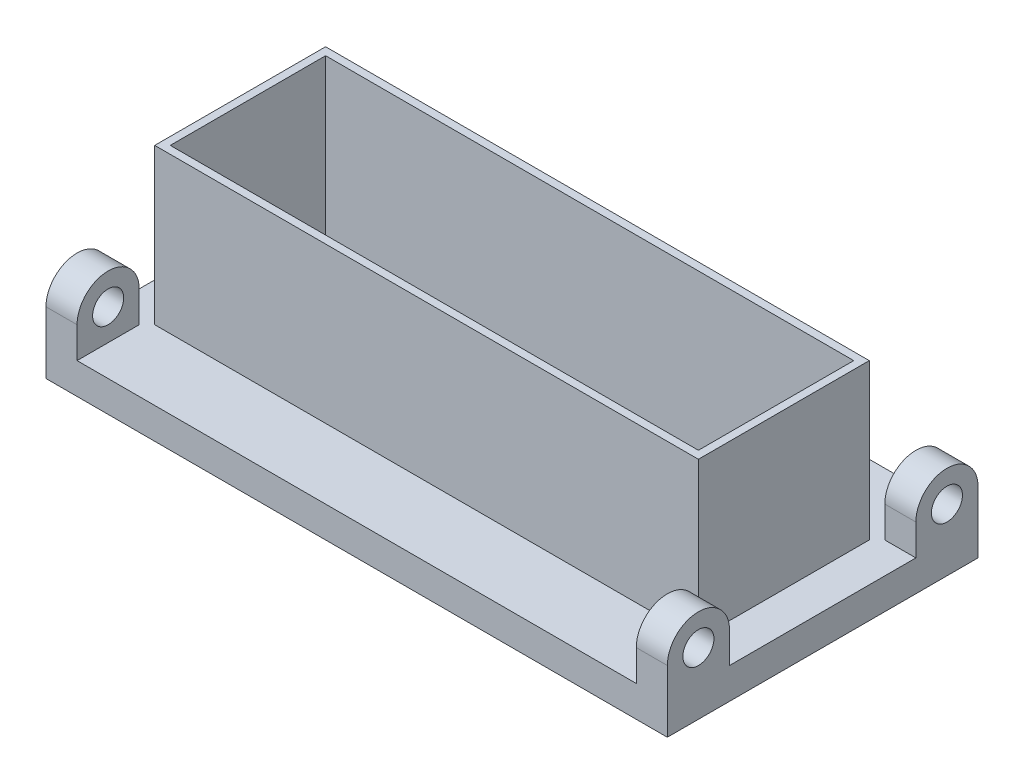
ISO-10303-21;
HEADER;
FILE_DESCRIPTION(('STEP AP214'),'2;1');
FILE_NAME('part.step','',(''),(''),'','','');
FILE_SCHEMA(('AUTOMOTIVE_DESIGN { 1 0 10303 214 1 1 1 1 }'));
ENDSEC;
DATA;
#1=APPLICATION_CONTEXT('core data for automotive mechanical design processes');
#2=APPLICATION_PROTOCOL_DEFINITION('international standard','automotive_design',2000,#1);
#3=PRODUCT_CONTEXT('',#1,'mechanical');
#4=PRODUCT('Part','Part','',(#3));
#5=PRODUCT_RELATED_PRODUCT_CATEGORY('part','',(#4));
#6=PRODUCT_DEFINITION_FORMATION('','',#4);
#7=PRODUCT_DEFINITION_CONTEXT('part definition',#1,'design');
#8=PRODUCT_DEFINITION('design','',#6,#7);
#9=PRODUCT_DEFINITION_SHAPE('','',#8);
#10=(LENGTH_UNIT() NAMED_UNIT(*) SI_UNIT(.MILLI.,.METRE.));
#11=(NAMED_UNIT(*) PLANE_ANGLE_UNIT() SI_UNIT($,.RADIAN.));
#12=(NAMED_UNIT(*) SI_UNIT($,.STERADIAN.) SOLID_ANGLE_UNIT());
#13=UNCERTAINTY_MEASURE_WITH_UNIT(LENGTH_MEASURE(1.E-05),#10,'distance_accuracy_value','');
#14=(GEOMETRIC_REPRESENTATION_CONTEXT(3) GLOBAL_UNCERTAINTY_ASSIGNED_CONTEXT((#13)) GLOBAL_UNIT_ASSIGNED_CONTEXT((#10,
#11,#12)) REPRESENTATION_CONTEXT('',''));
#15=CARTESIAN_POINT('',(0.,0.,0.));
#16=DIRECTION('',(0.,0.,1.));
#17=DIRECTION('',(1.,0.,0.));
#18=AXIS2_PLACEMENT_3D('',#15,#16,#17);
#19=CARTESIAN_POINT('',(100.,5.,50.));
#20=DIRECTION('',(0.,-1.,0.));
#21=DIRECTION('',(0.,0.,-1.));
#22=AXIS2_PLACEMENT_3D('',#19,#20,#21);
#23=PLANE('',#22);
#24=DIRECTION('',(1.,0.,0.));
#25=VECTOR('',#24,1.);
#26=CARTESIAN_POINT('',(0.,5.,-27.5));
#27=LINE('',#26,#25);
#28=CARTESIAN_POINT('',(-87.5,5.,-27.5));
#29=VERTEX_POINT('',#28);
#30=CARTESIAN_POINT('',(87.5,5.,-27.5));
#31=VERTEX_POINT('',#30);
#32=EDGE_CURVE('E61',#29,#31,#27,.T.);
#33=ORIENTED_EDGE('',*,*,#32,.T.);
#34=DIRECTION('',(0.,0.,1.));
#35=VECTOR('',#34,1.);
#36=CARTESIAN_POINT('',(87.5,5.,0.));
#37=LINE('',#36,#35);
#38=CARTESIAN_POINT('',(87.5,5.,27.5));
#39=VERTEX_POINT('',#38);
#40=EDGE_CURVE('E210',#31,#39,#37,.T.);
#41=ORIENTED_EDGE('',*,*,#40,.T.);
#42=DIRECTION('',(1.,0.,0.));
#43=VECTOR('',#42,1.);
#44=CARTESIAN_POINT('',(0.,5.,27.5));
#45=LINE('',#44,#43);
#46=CARTESIAN_POINT('',(-87.5,5.,27.5));
#47=VERTEX_POINT('',#46);
#48=EDGE_CURVE('E260',#47,#39,#45,.T.);
#49=ORIENTED_EDGE('',*,*,#48,.F.);
#50=DIRECTION('',(0.,0.,1.));
#51=VECTOR('',#50,1.);
#52=CARTESIAN_POINT('',(-87.5,5.,0.));
#53=LINE('',#52,#51);
#54=EDGE_CURVE('E66',#29,#47,#53,.T.);
#55=ORIENTED_EDGE('',*,*,#54,.F.);
#56=EDGE_LOOP('',(#33,#41,#49,#55));
#57=FACE_BOUND('',#56,.T.);
#58=DIRECTION('',(0.,0.,1.));
#59=VECTOR('',#58,1.);
#60=CARTESIAN_POINT('',(-100.,5.,50.));
#61=LINE('',#60,#59);
#62=CARTESIAN_POINT('',(-100.,5.,-30.));
#63=VERTEX_POINT('',#62);
#64=CARTESIAN_POINT('',(-100.,5.,30.));
#65=VERTEX_POINT('',#64);
#66=EDGE_CURVE('E483',#63,#65,#61,.T.);
#67=ORIENTED_EDGE('',*,*,#66,.T.);
#68=DIRECTION('',(-1.,0.,0.));
#69=VECTOR('',#68,1.);
#70=CARTESIAN_POINT('',(-90.,5.,30.));
#71=LINE('',#70,#69);
#72=CARTESIAN_POINT('',(-90.,5.,30.));
#73=VERTEX_POINT('',#72);
#74=EDGE_CURVE('E336',#73,#65,#71,.T.);
#75=ORIENTED_EDGE('',*,*,#74,.F.);
#76=DIRECTION('',(0.,0.,1.));
#77=VECTOR('',#76,1.);
#78=CARTESIAN_POINT('',(-90.,5.,0.));
#79=LINE('',#78,#77);
#80=CARTESIAN_POINT('',(-90.,5.,50.));
#81=VERTEX_POINT('',#80);
#82=EDGE_CURVE('E313',#73,#81,#79,.T.);
#83=ORIENTED_EDGE('',*,*,#82,.T.);
#84=DIRECTION('',(-1.,0.,0.));
#85=VECTOR('',#84,1.);
#86=CARTESIAN_POINT('',(100.,5.,50.));
#87=LINE('',#86,#85);
#88=CARTESIAN_POINT('',(90.,5.,50.));
#89=VERTEX_POINT('',#88);
#90=EDGE_CURVE('E54',#89,#81,#87,.T.);
#91=ORIENTED_EDGE('',*,*,#90,.F.);
#92=DIRECTION('',(0.,0.,1.));
#93=VECTOR('',#92,1.);
#94=CARTESIAN_POINT('',(90.,5.,0.));
#95=LINE('',#94,#93);
#96=CARTESIAN_POINT('',(90.,5.,30.));
#97=VERTEX_POINT('',#96);
#98=EDGE_CURVE('E439',#97,#89,#95,.T.);
#99=ORIENTED_EDGE('',*,*,#98,.F.);
#100=DIRECTION('',(1.,0.,0.));
#101=VECTOR('',#100,1.);
#102=CARTESIAN_POINT('',(90.,5.,30.));
#103=LINE('',#102,#101);
#104=CARTESIAN_POINT('',(100.,5.,30.));
#105=VERTEX_POINT('',#104);
#106=EDGE_CURVE('E460',#97,#105,#103,.T.);
#107=ORIENTED_EDGE('',*,*,#106,.T.);
#108=DIRECTION('',(0.,0.,1.));
#109=VECTOR('',#108,1.);
#110=CARTESIAN_POINT('',(100.,5.,50.));
#111=LINE('',#110,#109);
#112=CARTESIAN_POINT('',(100.,5.,-30.));
#113=VERTEX_POINT('',#112);
#114=EDGE_CURVE('E470',#113,#105,#111,.T.);
#115=ORIENTED_EDGE('',*,*,#114,.F.);
#116=DIRECTION('',(1.,0.,0.));
#117=VECTOR('',#116,1.);
#118=CARTESIAN_POINT('',(90.,5.,-30.));
#119=LINE('',#118,#117);
#120=CARTESIAN_POINT('',(90.,5.,-30.));
#121=VERTEX_POINT('',#120);
#122=EDGE_CURVE('E420',#121,#113,#119,.T.);
#123=ORIENTED_EDGE('',*,*,#122,.F.);
#124=DIRECTION('',(0.,0.,-1.));
#125=VECTOR('',#124,1.);
#126=CARTESIAN_POINT('',(90.,5.,0.));
#127=LINE('',#126,#125);
#128=CARTESIAN_POINT('',(90.,5.,-50.));
#129=VERTEX_POINT('',#128);
#130=EDGE_CURVE('E398',#121,#129,#127,.T.);
#131=ORIENTED_EDGE('',*,*,#130,.T.);
#132=DIRECTION('',(-1.,0.,0.));
#133=VECTOR('',#132,1.);
#134=CARTESIAN_POINT('',(100.,5.,-50.));
#135=LINE('',#134,#133);
#136=CARTESIAN_POINT('',(-90.,5.,-50.));
#137=VERTEX_POINT('',#136);
#138=EDGE_CURVE('E11',#129,#137,#135,.T.);
#139=ORIENTED_EDGE('',*,*,#138,.T.);
#140=DIRECTION('',(0.,0.,-1.));
#141=VECTOR('',#140,1.);
#142=CARTESIAN_POINT('',(-90.,5.,0.));
#143=LINE('',#142,#141);
#144=CARTESIAN_POINT('',(-90.,5.,-30.));
#145=VERTEX_POINT('',#144);
#146=EDGE_CURVE('E355',#145,#137,#143,.T.);
#147=ORIENTED_EDGE('',*,*,#146,.F.);
#148=DIRECTION('',(-1.,0.,0.));
#149=VECTOR('',#148,1.);
#150=CARTESIAN_POINT('',(-90.,5.,-30.));
#151=LINE('',#150,#149);
#152=EDGE_CURVE('E378',#145,#63,#151,.T.);
#153=ORIENTED_EDGE('',*,*,#152,.T.);
#154=EDGE_LOOP('',(#67,#75,#83,#91,#99,#107,#115,#123,#131,#139,#147,#153));
#155=FACE_BOUND('',#154,.T.);
#156=ADVANCED_FACE('F45',(#57,#155),#23,.F.);
#157=CARTESIAN_POINT('',(100.,5.,-50.));
#158=DIRECTION('',(0.,0.,1.));
#159=DIRECTION('',(1.,0.,0.));
#160=AXIS2_PLACEMENT_3D('',#157,#158,#159);
#161=PLANE('',#160);
#162=DIRECTION('',(0.,1.,0.));
#163=VECTOR('',#162,1.);
#164=CARTESIAN_POINT('',(-100.,5.,-50.));
#165=LINE('',#164,#163);
#166=CARTESIAN_POINT('',(-100.,-5.,-50.));
#167=VERTEX_POINT('',#166);
#168=CARTESIAN_POINT('',(-100.,15.,-50.));
#169=VERTEX_POINT('',#168);
#170=EDGE_CURVE('E459',#167,#169,#165,.T.);
#171=ORIENTED_EDGE('',*,*,#170,.T.);
#172=DIRECTION('',(-1.,0.,0.));
#173=VECTOR('',#172,1.);
#174=CARTESIAN_POINT('',(-90.,15.,-50.));
#175=LINE('',#174,#173);
#176=CARTESIAN_POINT('',(-90.,15.,-50.));
#177=VERTEX_POINT('',#176);
#178=EDGE_CURVE('E363',#177,#169,#175,.T.);
#179=ORIENTED_EDGE('',*,*,#178,.F.);
#180=DIRECTION('',(0.,-1.,0.));
#181=VECTOR('',#180,1.);
#182=CARTESIAN_POINT('',(-90.,0.,-50.));
#183=LINE('',#182,#181);
#184=EDGE_CURVE('E351',#177,#137,#183,.T.);
#185=ORIENTED_EDGE('',*,*,#184,.T.);
#186=ORIENTED_EDGE('',*,*,#138,.F.);
#187=DIRECTION('',(0.,-1.,0.));
#188=VECTOR('',#187,1.);
#189=CARTESIAN_POINT('',(90.,0.,-50.));
#190=LINE('',#189,#188);
#191=CARTESIAN_POINT('',(90.,15.,-50.));
#192=VERTEX_POINT('',#191);
#193=EDGE_CURVE('E402',#192,#129,#190,.T.);
#194=ORIENTED_EDGE('',*,*,#193,.F.);
#195=DIRECTION('',(1.,0.,0.));
#196=VECTOR('',#195,1.);
#197=CARTESIAN_POINT('',(90.,15.,-50.));
#198=LINE('',#197,#196);
#199=CARTESIAN_POINT('',(100.,15.,-50.));
#200=VERTEX_POINT('',#199);
#201=EDGE_CURVE('E415',#192,#200,#198,.T.);
#202=ORIENTED_EDGE('',*,*,#201,.T.);
#203=DIRECTION('',(0.,1.,0.));
#204=VECTOR('',#203,1.);
#205=CARTESIAN_POINT('',(100.,5.,-50.));
#206=LINE('',#205,#204);
#207=CARTESIAN_POINT('',(100.,-5.,-50.));
#208=VERTEX_POINT('',#207);
#209=EDGE_CURVE('E467',#208,#200,#206,.T.);
#210=ORIENTED_EDGE('',*,*,#209,.F.);
#211=DIRECTION('',(-1.,0.,0.));
#212=VECTOR('',#211,1.);
#213=CARTESIAN_POINT('',(100.,-5.,-50.));
#214=LINE('',#213,#212);
#215=EDGE_CURVE('E480',#208,#167,#214,.T.);
#216=ORIENTED_EDGE('',*,*,#215,.T.);
#217=EDGE_LOOP('',(#171,#179,#185,#186,#194,#202,#210,#216));
#218=FACE_BOUND('',#217,.T.);
#219=ADVANCED_FACE('F47',(#218),#161,.F.);
#220=CARTESIAN_POINT('',(100.,5.,50.));
#221=DIRECTION('',(0.,0.,-1.));
#222=DIRECTION('',(-1.,0.,0.));
#223=AXIS2_PLACEMENT_3D('',#220,#221,#222);
#224=PLANE('',#223);
#225=DIRECTION('',(0.,-1.,0.));
#226=VECTOR('',#225,1.);
#227=CARTESIAN_POINT('',(-100.,5.,50.));
#228=LINE('',#227,#226);
#229=CARTESIAN_POINT('',(-100.,15.,50.));
#230=VERTEX_POINT('',#229);
#231=CARTESIAN_POINT('',(-100.,-5.,50.));
#232=VERTEX_POINT('',#231);
#233=EDGE_CURVE('E486',#230,#232,#228,.T.);
#234=ORIENTED_EDGE('',*,*,#233,.T.);
#235=DIRECTION('',(-1.,0.,0.));
#236=VECTOR('',#235,1.);
#237=CARTESIAN_POINT('',(100.,-5.,50.));
#238=LINE('',#237,#236);
#239=CARTESIAN_POINT('',(100.,-5.,50.));
#240=VERTEX_POINT('',#239);
#241=EDGE_CURVE('E494',#240,#232,#238,.T.);
#242=ORIENTED_EDGE('',*,*,#241,.F.);
#243=DIRECTION('',(0.,-1.,0.));
#244=VECTOR('',#243,1.);
#245=CARTESIAN_POINT('',(100.,5.,50.));
#246=LINE('',#245,#244);
#247=CARTESIAN_POINT('',(100.,15.,50.));
#248=VERTEX_POINT('',#247);
#249=EDGE_CURVE('E474',#248,#240,#246,.T.);
#250=ORIENTED_EDGE('',*,*,#249,.F.);
#251=DIRECTION('',(1.,0.,0.));
#252=VECTOR('',#251,1.);
#253=CARTESIAN_POINT('',(90.,15.,50.));
#254=LINE('',#253,#252);
#255=CARTESIAN_POINT('',(90.,15.,50.));
#256=VERTEX_POINT('',#255);
#257=EDGE_CURVE('E445',#256,#248,#254,.T.);
#258=ORIENTED_EDGE('',*,*,#257,.F.);
#259=DIRECTION('',(0.,-1.,0.));
#260=VECTOR('',#259,1.);
#261=CARTESIAN_POINT('',(90.,0.,50.));
#262=LINE('',#261,#260);
#263=EDGE_CURVE('E435',#256,#89,#262,.T.);
#264=ORIENTED_EDGE('',*,*,#263,.T.);
#265=ORIENTED_EDGE('',*,*,#90,.T.);
#266=DIRECTION('',(0.,-1.,0.));
#267=VECTOR('',#266,1.);
#268=CARTESIAN_POINT('',(-90.,0.,50.));
#269=LINE('',#268,#267);
#270=CARTESIAN_POINT('',(-90.,15.,50.));
#271=VERTEX_POINT('',#270);
#272=EDGE_CURVE('E316',#271,#81,#269,.T.);
#273=ORIENTED_EDGE('',*,*,#272,.F.);
#274=DIRECTION('',(-1.,0.,0.));
#275=VECTOR('',#274,1.);
#276=CARTESIAN_POINT('',(-90.,15.,50.));
#277=LINE('',#276,#275);
#278=EDGE_CURVE('E331',#271,#230,#277,.T.);
#279=ORIENTED_EDGE('',*,*,#278,.T.);
#280=EDGE_LOOP('',(#234,#242,#250,#258,#264,#265,#273,#279));
#281=FACE_BOUND('',#280,.T.);
#282=ADVANCED_FACE('F501',(#281),#224,.F.);
#283=CARTESIAN_POINT('',(100.,-5.,50.));
#284=DIRECTION('',(0.,1.,0.));
#285=DIRECTION('',(0.,0.,1.));
#286=AXIS2_PLACEMENT_3D('',#283,#284,#285);
#287=PLANE('',#286);
#288=DIRECTION('',(0.,0.,-1.));
#289=VECTOR('',#288,1.);
#290=CARTESIAN_POINT('',(-100.,-5.,50.));
#291=LINE('',#290,#289);
#292=EDGE_CURVE('E471',#232,#167,#291,.T.);
#293=ORIENTED_EDGE('',*,*,#292,.T.);
#294=ORIENTED_EDGE('',*,*,#215,.F.);
#295=DIRECTION('',(0.,0.,-1.));
#296=VECTOR('',#295,1.);
#297=CARTESIAN_POINT('',(100.,-5.,50.));
#298=LINE('',#297,#296);
#299=EDGE_CURVE('E477',#240,#208,#298,.T.);
#300=ORIENTED_EDGE('',*,*,#299,.F.);
#301=ORIENTED_EDGE('',*,*,#241,.T.);
#302=EDGE_LOOP('',(#293,#294,#300,#301));
#303=FACE_BOUND('',#302,.T.);
#304=ADVANCED_FACE('F519',(#303),#287,.F.);
#305=CARTESIAN_POINT('',(100.,0.,0.));
#306=DIRECTION('',(1.,0.,0.));
#307=DIRECTION('',(0.,0.,-1.));
#308=AXIS2_PLACEMENT_3D('',#305,#306,#307);
#309=PLANE('',#308);
#310=ORIENTED_EDGE('',*,*,#209,.T.);
#311=CARTESIAN_POINT('',(100.,15.,-40.));
#312=DIRECTION('',(-1.,0.,0.));
#313=DIRECTION('',(0.,0.,1.));
#314=AXIS2_PLACEMENT_3D('',#311,#312,#313);
#315=CIRCLE('',#314,10.);
#316=CARTESIAN_POINT('',(100.,15.,-30.));
#317=VERTEX_POINT('',#316);
#318=EDGE_CURVE('E409',#317,#200,#315,.T.);
#319=ORIENTED_EDGE('',*,*,#318,.F.);
#320=DIRECTION('',(0.,-1.,0.));
#321=VECTOR('',#320,1.);
#322=CARTESIAN_POINT('',(100.,0.,-30.));
#323=LINE('',#322,#321);
#324=EDGE_CURVE('E390',#317,#113,#323,.T.);
#325=ORIENTED_EDGE('',*,*,#324,.T.);
#326=ORIENTED_EDGE('',*,*,#114,.T.);
#327=DIRECTION('',(0.,-1.,0.));
#328=VECTOR('',#327,1.);
#329=CARTESIAN_POINT('',(100.,0.,30.));
#330=LINE('',#329,#328);
#331=CARTESIAN_POINT('',(100.,15.,30.));
#332=VERTEX_POINT('',#331);
#333=EDGE_CURVE('E431',#332,#105,#330,.T.);
#334=ORIENTED_EDGE('',*,*,#333,.F.);
#335=CARTESIAN_POINT('',(100.,15.,40.));
#336=DIRECTION('',(1.,0.,0.));
#337=DIRECTION('',(0.,0.,-1.));
#338=AXIS2_PLACEMENT_3D('',#335,#336,#337);
#339=CIRCLE('',#338,10.);
#340=EDGE_CURVE('E449',#332,#248,#339,.T.);
#341=ORIENTED_EDGE('',*,*,#340,.T.);
#342=ORIENTED_EDGE('',*,*,#249,.T.);
#343=ORIENTED_EDGE('',*,*,#299,.T.);
#344=EDGE_LOOP('',(#310,#319,#325,#326,#334,#341,#342,#343));
#345=FACE_BOUND('',#344,.T.);
#346=CARTESIAN_POINT('',(100.,15.,40.));
#347=DIRECTION('',(1.,0.,0.));
#348=DIRECTION('',(0.,0.,-1.));
#349=AXIS2_PLACEMENT_3D('',#346,#347,#348);
#350=CIRCLE('',#349,5.);
#351=CARTESIAN_POINT('',(100.,15.,35.));
#352=VERTEX_POINT('',#351);
#353=EDGE_CURVE('E419',#352,#352,#350,.T.);
#354=ORIENTED_EDGE('',*,*,#353,.F.);
#355=EDGE_LOOP('',(#354));
#356=FACE_BOUND('',#355,.T.);
#357=CARTESIAN_POINT('',(100.,15.,-40.));
#358=DIRECTION('',(-1.,0.,0.));
#359=DIRECTION('',(0.,0.,1.));
#360=AXIS2_PLACEMENT_3D('',#357,#358,#359);
#361=CIRCLE('',#360,5.);
#362=CARTESIAN_POINT('',(100.,15.,-35.));
#363=VERTEX_POINT('',#362);
#364=EDGE_CURVE('E377',#363,#363,#361,.T.);
#365=ORIENTED_EDGE('',*,*,#364,.T.);
#366=EDGE_LOOP('',(#365));
#367=FACE_BOUND('',#366,.T.);
#368=ADVANCED_FACE('F551',(#345,#356,#367),#309,.T.);
#369=CARTESIAN_POINT('',(-100.,0.,0.));
#370=DIRECTION('',(1.,0.,0.));
#371=DIRECTION('',(0.,0.,-1.));
#372=AXIS2_PLACEMENT_3D('',#369,#370,#371);
#373=PLANE('',#372);
#374=ORIENTED_EDGE('',*,*,#170,.F.);
#375=ORIENTED_EDGE('',*,*,#292,.F.);
#376=ORIENTED_EDGE('',*,*,#233,.F.);
#377=CARTESIAN_POINT('',(-100.,15.,40.));
#378=DIRECTION('',(1.,0.,0.));
#379=DIRECTION('',(0.,0.,-1.));
#380=AXIS2_PLACEMENT_3D('',#377,#378,#379);
#381=CIRCLE('',#380,10.);
#382=CARTESIAN_POINT('',(-100.,15.,30.));
#383=VERTEX_POINT('',#382);
#384=EDGE_CURVE('E324',#383,#230,#381,.T.);
#385=ORIENTED_EDGE('',*,*,#384,.F.);
#386=DIRECTION('',(0.,-1.,0.));
#387=VECTOR('',#386,1.);
#388=CARTESIAN_POINT('',(-100.,0.,30.));
#389=LINE('',#388,#387);
#390=EDGE_CURVE('E305',#383,#65,#389,.T.);
#391=ORIENTED_EDGE('',*,*,#390,.T.);
#392=ORIENTED_EDGE('',*,*,#66,.F.);
#393=DIRECTION('',(0.,-1.,0.));
#394=VECTOR('',#393,1.);
#395=CARTESIAN_POINT('',(-100.,0.,-30.));
#396=LINE('',#395,#394);
#397=CARTESIAN_POINT('',(-100.,15.,-30.));
#398=VERTEX_POINT('',#397);
#399=EDGE_CURVE('E347',#398,#63,#396,.T.);
#400=ORIENTED_EDGE('',*,*,#399,.F.);
#401=CARTESIAN_POINT('',(-100.,15.,-40.));
#402=DIRECTION('',(-1.,0.,0.));
#403=DIRECTION('',(0.,0.,1.));
#404=AXIS2_PLACEMENT_3D('',#401,#402,#403);
#405=CIRCLE('',#404,10.);
#406=EDGE_CURVE('E367',#398,#169,#405,.T.);
#407=ORIENTED_EDGE('',*,*,#406,.T.);
#408=EDGE_LOOP('',(#374,#375,#376,#385,#391,#392,#400,#407));
#409=FACE_BOUND('',#408,.T.);
#410=CARTESIAN_POINT('',(-100.,15.,-40.));
#411=DIRECTION('',(-1.,0.,0.));
#412=DIRECTION('',(0.,0.,1.));
#413=AXIS2_PLACEMENT_3D('',#410,#411,#412);
#414=CIRCLE('',#413,5.);
#415=CARTESIAN_POINT('',(-100.,15.,-35.));
#416=VERTEX_POINT('',#415);
#417=EDGE_CURVE('E335',#416,#416,#414,.T.);
#418=ORIENTED_EDGE('',*,*,#417,.F.);
#419=EDGE_LOOP('',(#418));
#420=FACE_BOUND('',#419,.T.);
#421=CARTESIAN_POINT('',(-100.,15.,40.));
#422=DIRECTION('',(1.,0.,0.));
#423=DIRECTION('',(0.,0.,-1.));
#424=AXIS2_PLACEMENT_3D('',#421,#422,#423);
#425=CIRCLE('',#424,5.);
#426=CARTESIAN_POINT('',(-100.,15.,35.));
#427=VERTEX_POINT('',#426);
#428=EDGE_CURVE('E291',#427,#427,#425,.T.);
#429=ORIENTED_EDGE('',*,*,#428,.T.);
#430=EDGE_LOOP('',(#429));
#431=FACE_BOUND('',#430,.T.);
#432=ADVANCED_FACE('F522',(#409,#420,#431),#373,.F.);
#433=CARTESIAN_POINT('',(90.,15.,40.));
#434=DIRECTION('',(1.,0.,0.));
#435=DIRECTION('',(0.,0.,-1.));
#436=AXIS2_PLACEMENT_3D('',#433,#434,#435);
#437=CYLINDRICAL_SURFACE('',#436,10.);
#438=ORIENTED_EDGE('',*,*,#340,.F.);
#439=DIRECTION('',(1.,0.,0.));
#440=VECTOR('',#439,1.);
#441=CARTESIAN_POINT('',(90.,15.,30.));
#442=LINE('',#441,#440);
#443=CARTESIAN_POINT('',(90.,15.,30.));
#444=VERTEX_POINT('',#443);
#445=EDGE_CURVE('E456',#444,#332,#442,.T.);
#446=ORIENTED_EDGE('',*,*,#445,.F.);
#447=CARTESIAN_POINT('',(90.,15.,40.));
#448=DIRECTION('',(1.,0.,0.));
#449=DIRECTION('',(0.,0.,-1.));
#450=AXIS2_PLACEMENT_3D('',#447,#448,#449);
#451=CIRCLE('',#450,10.);
#452=EDGE_CURVE('E430',#444,#256,#451,.T.);
#453=ORIENTED_EDGE('',*,*,#452,.T.);
#454=ORIENTED_EDGE('',*,*,#257,.T.);
#455=EDGE_LOOP('',(#438,#446,#453,#454));
#456=FACE_BOUND('',#455,.T.);
#457=ADVANCED_FACE('F556',(#456),#437,.T.);
#458=CARTESIAN_POINT('',(90.,0.,30.));
#459=DIRECTION('',(0.,0.,1.));
#460=DIRECTION('',(1.,0.,0.));
#461=AXIS2_PLACEMENT_3D('',#458,#459,#460);
#462=PLANE('',#461);
#463=ORIENTED_EDGE('',*,*,#333,.T.);
#464=ORIENTED_EDGE('',*,*,#106,.F.);
#465=DIRECTION('',(0.,-1.,0.));
#466=VECTOR('',#465,1.);
#467=CARTESIAN_POINT('',(90.,0.,30.));
#468=LINE('',#467,#466);
#469=EDGE_CURVE('E442',#444,#97,#468,.T.);
#470=ORIENTED_EDGE('',*,*,#469,.F.);
#471=ORIENTED_EDGE('',*,*,#445,.T.);
#472=EDGE_LOOP('',(#463,#464,#470,#471));
#473=FACE_BOUND('',#472,.T.);
#474=ADVANCED_FACE('F563',(#473),#462,.F.);
#475=CARTESIAN_POINT('',(90.,15.,40.));
#476=DIRECTION('',(1.,0.,0.));
#477=DIRECTION('',(0.,0.,-1.));
#478=AXIS2_PLACEMENT_3D('',#475,#476,#477);
#479=CYLINDRICAL_SURFACE('',#478,5.);
#480=CARTESIAN_POINT('',(90.,15.,40.));
#481=DIRECTION('',(1.,0.,0.));
#482=DIRECTION('',(0.,0.,-1.));
#483=AXIS2_PLACEMENT_3D('',#480,#481,#482);
#484=CIRCLE('',#483,5.);
#485=CARTESIAN_POINT('',(90.,15.,35.));
#486=VERTEX_POINT('',#485);
#487=EDGE_CURVE('E426',#486,#486,#484,.T.);
#488=ORIENTED_EDGE('',*,*,#487,.F.);
#489=EDGE_LOOP('',(#488));
#490=FACE_BOUND('',#489,.T.);
#491=ORIENTED_EDGE('',*,*,#353,.T.);
#492=EDGE_LOOP('',(#491));
#493=FACE_BOUND('',#492,.T.);
#494=ADVANCED_FACE('F565',(#490,#493),#479,.F.);
#495=CARTESIAN_POINT('',(90.,0.,0.));
#496=DIRECTION('',(1.,0.,0.));
#497=DIRECTION('',(0.,0.,-1.));
#498=AXIS2_PLACEMENT_3D('',#495,#496,#497);
#499=PLANE('',#498);
#500=ORIENTED_EDGE('',*,*,#487,.T.);
#501=EDGE_LOOP('',(#500));
#502=FACE_BOUND('',#501,.T.);
#503=ORIENTED_EDGE('',*,*,#452,.F.);
#504=ORIENTED_EDGE('',*,*,#469,.T.);
#505=ORIENTED_EDGE('',*,*,#98,.T.);
#506=ORIENTED_EDGE('',*,*,#263,.F.);
#507=EDGE_LOOP('',(#503,#504,#505,#506));
#508=FACE_BOUND('',#507,.T.);
#509=ADVANCED_FACE('F560',(#502,#508),#499,.F.);
#510=CARTESIAN_POINT('',(90.,15.,-40.));
#511=DIRECTION('',(1.,0.,0.));
#512=DIRECTION('',(0.,0.,-1.));
#513=AXIS2_PLACEMENT_3D('',#510,#511,#512);
#514=CYLINDRICAL_SURFACE('',#513,10.);
#515=ORIENTED_EDGE('',*,*,#318,.T.);
#516=ORIENTED_EDGE('',*,*,#201,.F.);
#517=CARTESIAN_POINT('',(90.,15.,-40.));
#518=DIRECTION('',(-1.,0.,0.));
#519=DIRECTION('',(0.,0.,1.));
#520=AXIS2_PLACEMENT_3D('',#517,#518,#519);
#521=CIRCLE('',#520,10.);
#522=CARTESIAN_POINT('',(90.,15.,-30.));
#523=VERTEX_POINT('',#522);
#524=EDGE_CURVE('E389',#523,#192,#521,.T.);
#525=ORIENTED_EDGE('',*,*,#524,.F.);
#526=DIRECTION('',(1.,0.,0.));
#527=VECTOR('',#526,1.);
#528=CARTESIAN_POINT('',(90.,15.,-30.));
#529=LINE('',#528,#527);
#530=EDGE_CURVE('E405',#523,#317,#529,.T.);
#531=ORIENTED_EDGE('',*,*,#530,.T.);
#532=EDGE_LOOP('',(#515,#516,#525,#531));
#533=FACE_BOUND('',#532,.T.);
#534=ADVANCED_FACE('F549',(#533),#514,.T.);
#535=CARTESIAN_POINT('',(90.,15.,-40.));
#536=DIRECTION('',(1.,0.,0.));
#537=DIRECTION('',(0.,0.,-1.));
#538=AXIS2_PLACEMENT_3D('',#535,#536,#537);
#539=CYLINDRICAL_SURFACE('',#538,5.);
#540=CARTESIAN_POINT('',(90.,15.,-40.));
#541=DIRECTION('',(-1.,0.,0.));
#542=DIRECTION('',(0.,0.,1.));
#543=AXIS2_PLACEMENT_3D('',#540,#541,#542);
#544=CIRCLE('',#543,5.);
#545=CARTESIAN_POINT('',(90.,15.,-35.));
#546=VERTEX_POINT('',#545);
#547=EDGE_CURVE('E385',#546,#546,#544,.T.);
#548=ORIENTED_EDGE('',*,*,#547,.T.);
#549=EDGE_LOOP('',(#548));
#550=FACE_BOUND('',#549,.T.);
#551=ORIENTED_EDGE('',*,*,#364,.F.);
#552=EDGE_LOOP('',(#551));
#553=FACE_BOUND('',#552,.T.);
#554=ADVANCED_FACE('F659',(#550,#553),#539,.F.);
#555=CARTESIAN_POINT('',(90.,0.,-30.));
#556=DIRECTION('',(0.,0.,1.));
#557=DIRECTION('',(1.,0.,0.));
#558=AXIS2_PLACEMENT_3D('',#555,#556,#557);
#559=PLANE('',#558);
#560=ORIENTED_EDGE('',*,*,#324,.F.);
#561=ORIENTED_EDGE('',*,*,#530,.F.);
#562=DIRECTION('',(0.,-1.,0.));
#563=VECTOR('',#562,1.);
#564=CARTESIAN_POINT('',(90.,0.,-30.));
#565=LINE('',#564,#563);
#566=EDGE_CURVE('E394',#523,#121,#565,.T.);
#567=ORIENTED_EDGE('',*,*,#566,.T.);
#568=ORIENTED_EDGE('',*,*,#122,.T.);
#569=EDGE_LOOP('',(#560,#561,#567,#568));
#570=FACE_BOUND('',#569,.T.);
#571=ADVANCED_FACE('F544',(#570),#559,.T.);
#572=CARTESIAN_POINT('',(90.,0.,0.));
#573=DIRECTION('',(1.,0.,0.));
#574=DIRECTION('',(0.,0.,1.));
#575=AXIS2_PLACEMENT_3D('',#572,#573,#574);
#576=PLANE('',#575);
#577=ORIENTED_EDGE('',*,*,#547,.F.);
#578=EDGE_LOOP('',(#577));
#579=FACE_BOUND('',#578,.T.);
#580=ORIENTED_EDGE('',*,*,#524,.T.);
#581=ORIENTED_EDGE('',*,*,#193,.T.);
#582=ORIENTED_EDGE('',*,*,#130,.F.);
#583=ORIENTED_EDGE('',*,*,#566,.F.);
#584=EDGE_LOOP('',(#580,#581,#582,#583));
#585=FACE_BOUND('',#584,.T.);
#586=ADVANCED_FACE('F541',(#579,#585),#576,.F.);
#587=CARTESIAN_POINT('',(-90.,15.,-40.));
#588=DIRECTION('',(-1.,0.,0.));
#589=DIRECTION('',(0.,0.,1.));
#590=AXIS2_PLACEMENT_3D('',#587,#588,#589);
#591=CYLINDRICAL_SURFACE('',#590,10.);
#592=ORIENTED_EDGE('',*,*,#406,.F.);
#593=DIRECTION('',(-1.,0.,0.));
#594=VECTOR('',#593,1.);
#595=CARTESIAN_POINT('',(-90.,15.,-30.));
#596=LINE('',#595,#594);
#597=CARTESIAN_POINT('',(-90.,15.,-30.));
#598=VERTEX_POINT('',#597);
#599=EDGE_CURVE('E374',#598,#398,#596,.T.);
#600=ORIENTED_EDGE('',*,*,#599,.F.);
#601=CARTESIAN_POINT('',(-90.,15.,-40.));
#602=DIRECTION('',(-1.,0.,0.));
#603=DIRECTION('',(0.,0.,1.));
#604=AXIS2_PLACEMENT_3D('',#601,#602,#603);
#605=CIRCLE('',#604,10.);
#606=EDGE_CURVE('E346',#598,#177,#605,.T.);
#607=ORIENTED_EDGE('',*,*,#606,.T.);
#608=ORIENTED_EDGE('',*,*,#178,.T.);
#609=EDGE_LOOP('',(#592,#600,#607,#608));
#610=FACE_BOUND('',#609,.T.);
#611=ADVANCED_FACE('F530',(#610),#591,.T.);
#612=CARTESIAN_POINT('',(-90.,0.,-30.));
#613=DIRECTION('',(0.,0.,-1.));
#614=DIRECTION('',(-1.,0.,0.));
#615=AXIS2_PLACEMENT_3D('',#612,#613,#614);
#616=PLANE('',#615);
#617=ORIENTED_EDGE('',*,*,#399,.T.);
#618=ORIENTED_EDGE('',*,*,#152,.F.);
#619=DIRECTION('',(0.,-1.,0.));
#620=VECTOR('',#619,1.);
#621=CARTESIAN_POINT('',(-90.,0.,-30.));
#622=LINE('',#621,#620);
#623=EDGE_CURVE('E359',#598,#145,#622,.T.);
#624=ORIENTED_EDGE('',*,*,#623,.F.);
#625=ORIENTED_EDGE('',*,*,#599,.T.);
#626=EDGE_LOOP('',(#617,#618,#624,#625));
#627=FACE_BOUND('',#626,.T.);
#628=ADVANCED_FACE('F645',(#627),#616,.F.);
#629=CARTESIAN_POINT('',(-90.,15.,-40.));
#630=DIRECTION('',(-1.,0.,0.));
#631=DIRECTION('',(0.,0.,1.));
#632=AXIS2_PLACEMENT_3D('',#629,#630,#631);
#633=CYLINDRICAL_SURFACE('',#632,5.);
#634=CARTESIAN_POINT('',(-90.,15.,-40.));
#635=DIRECTION('',(-1.,0.,0.));
#636=DIRECTION('',(0.,0.,1.));
#637=AXIS2_PLACEMENT_3D('',#634,#635,#636);
#638=CIRCLE('',#637,5.);
#639=CARTESIAN_POINT('',(-90.,15.,-35.));
#640=VERTEX_POINT('',#639);
#641=EDGE_CURVE('E342',#640,#640,#638,.T.);
#642=ORIENTED_EDGE('',*,*,#641,.F.);
#643=EDGE_LOOP('',(#642));
#644=FACE_BOUND('',#643,.T.);
#645=ORIENTED_EDGE('',*,*,#417,.T.);
#646=EDGE_LOOP('',(#645));
#647=FACE_BOUND('',#646,.T.);
#648=ADVANCED_FACE('F643',(#644,#647),#633,.F.);
#649=CARTESIAN_POINT('',(-90.,0.,0.));
#650=DIRECTION('',(-1.,0.,0.));
#651=DIRECTION('',(0.,0.,1.));
#652=AXIS2_PLACEMENT_3D('',#649,#650,#651);
#653=PLANE('',#652);
#654=ORIENTED_EDGE('',*,*,#641,.T.);
#655=EDGE_LOOP('',(#654));
#656=FACE_BOUND('',#655,.T.);
#657=ORIENTED_EDGE('',*,*,#606,.F.);
#658=ORIENTED_EDGE('',*,*,#623,.T.);
#659=ORIENTED_EDGE('',*,*,#146,.T.);
#660=ORIENTED_EDGE('',*,*,#184,.F.);
#661=EDGE_LOOP('',(#657,#658,#659,#660));
#662=FACE_BOUND('',#661,.T.);
#663=ADVANCED_FACE('F534',(#656,#662),#653,.F.);
#664=CARTESIAN_POINT('',(-90.,15.,40.));
#665=DIRECTION('',(-1.,0.,0.));
#666=DIRECTION('',(0.,0.,1.));
#667=AXIS2_PLACEMENT_3D('',#664,#665,#666);
#668=CYLINDRICAL_SURFACE('',#667,10.);
#669=ORIENTED_EDGE('',*,*,#384,.T.);
#670=ORIENTED_EDGE('',*,*,#278,.F.);
#671=CARTESIAN_POINT('',(-90.,15.,40.));
#672=DIRECTION('',(1.,0.,0.));
#673=DIRECTION('',(0.,0.,-1.));
#674=AXIS2_PLACEMENT_3D('',#671,#672,#673);
#675=CIRCLE('',#674,10.);
#676=CARTESIAN_POINT('',(-90.,15.,30.));
#677=VERTEX_POINT('',#676);
#678=EDGE_CURVE('E304',#677,#271,#675,.T.);
#679=ORIENTED_EDGE('',*,*,#678,.F.);
#680=DIRECTION('',(-1.,0.,0.));
#681=VECTOR('',#680,1.);
#682=CARTESIAN_POINT('',(-90.,15.,30.));
#683=LINE('',#682,#681);
#684=EDGE_CURVE('E320',#677,#383,#683,.T.);
#685=ORIENTED_EDGE('',*,*,#684,.T.);
#686=EDGE_LOOP('',(#669,#670,#679,#685));
#687=FACE_BOUND('',#686,.T.);
#688=ADVANCED_FACE('F512',(#687),#668,.T.);
#689=CARTESIAN_POINT('',(-90.,15.,40.));
#690=DIRECTION('',(-1.,0.,0.));
#691=DIRECTION('',(0.,0.,1.));
#692=AXIS2_PLACEMENT_3D('',#689,#690,#691);
#693=CYLINDRICAL_SURFACE('',#692,5.);
#694=CARTESIAN_POINT('',(-90.,15.,40.));
#695=DIRECTION('',(1.,0.,0.));
#696=DIRECTION('',(0.,0.,-1.));
#697=AXIS2_PLACEMENT_3D('',#694,#695,#696);
#698=CIRCLE('',#697,5.);
#699=CARTESIAN_POINT('',(-90.,15.,35.));
#700=VERTEX_POINT('',#699);
#701=EDGE_CURVE('E300',#700,#700,#698,.T.);
#702=ORIENTED_EDGE('',*,*,#701,.T.);
#703=EDGE_LOOP('',(#702));
#704=FACE_BOUND('',#703,.T.);
#705=ORIENTED_EDGE('',*,*,#428,.F.);
#706=EDGE_LOOP('',(#705));
#707=FACE_BOUND('',#706,.T.);
#708=ADVANCED_FACE('F634',(#704,#707),#693,.F.);
#709=CARTESIAN_POINT('',(-90.,0.,30.));
#710=DIRECTION('',(0.,0.,-1.));
#711=DIRECTION('',(-1.,0.,0.));
#712=AXIS2_PLACEMENT_3D('',#709,#710,#711);
#713=PLANE('',#712);
#714=ORIENTED_EDGE('',*,*,#390,.F.);
#715=ORIENTED_EDGE('',*,*,#684,.F.);
#716=DIRECTION('',(0.,-1.,0.));
#717=VECTOR('',#716,1.);
#718=CARTESIAN_POINT('',(-90.,0.,30.));
#719=LINE('',#718,#717);
#720=EDGE_CURVE('E309',#677,#73,#719,.T.);
#721=ORIENTED_EDGE('',*,*,#720,.T.);
#722=ORIENTED_EDGE('',*,*,#74,.T.);
#723=EDGE_LOOP('',(#714,#715,#721,#722));
#724=FACE_BOUND('',#723,.T.);
#725=ADVANCED_FACE('F630',(#724),#713,.T.);
#726=CARTESIAN_POINT('',(-90.,0.,0.));
#727=DIRECTION('',(-1.,0.,0.));
#728=DIRECTION('',(0.,0.,-1.));
#729=AXIS2_PLACEMENT_3D('',#726,#727,#728);
#730=PLANE('',#729);
#731=ORIENTED_EDGE('',*,*,#701,.F.);
#732=EDGE_LOOP('',(#731));
#733=FACE_BOUND('',#732,.T.);
#734=ORIENTED_EDGE('',*,*,#678,.T.);
#735=ORIENTED_EDGE('',*,*,#272,.T.);
#736=ORIENTED_EDGE('',*,*,#82,.F.);
#737=ORIENTED_EDGE('',*,*,#720,.F.);
#738=EDGE_LOOP('',(#734,#735,#736,#737));
#739=FACE_BOUND('',#738,.T.);
#740=ADVANCED_FACE('F507',(#733,#739),#730,.F.);
#741=CARTESIAN_POINT('',(0.,55.,-25.));
#742=DIRECTION('',(0.,0.,-1.));
#743=DIRECTION('',(-1.,0.,0.));
#744=AXIS2_PLACEMENT_3D('',#741,#742,#743);
#745=PLANE('',#744);
#746=DIRECTION('',(1.,0.,0.));
#747=VECTOR('',#746,1.);
#748=CARTESIAN_POINT('',(0.,5.,-25.));
#749=LINE('',#748,#747);
#750=CARTESIAN_POINT('',(-85.,5.,-25.));
#751=VERTEX_POINT('',#750);
#752=CARTESIAN_POINT('',(85.,5.,-25.));
#753=VERTEX_POINT('',#752);
#754=EDGE_CURVE('E264',#751,#753,#749,.T.);
#755=ORIENTED_EDGE('',*,*,#754,.T.);
#756=DIRECTION('',(0.,-1.,0.));
#757=VECTOR('',#756,1.);
#758=CARTESIAN_POINT('',(85.,55.,-25.));
#759=LINE('',#758,#757);
#760=CARTESIAN_POINT('',(85.,55.,-25.));
#761=VERTEX_POINT('',#760);
#762=EDGE_CURVE('E288',#761,#753,#759,.T.);
#763=ORIENTED_EDGE('',*,*,#762,.F.);
#764=DIRECTION('',(1.,0.,0.));
#765=VECTOR('',#764,1.);
#766=CARTESIAN_POINT('',(0.,55.,-25.));
#767=LINE('',#766,#765);
#768=CARTESIAN_POINT('',(-85.,55.,-25.));
#769=VERTEX_POINT('',#768);
#770=EDGE_CURVE('E238',#769,#761,#767,.T.);
#771=ORIENTED_EDGE('',*,*,#770,.F.);
#772=DIRECTION('',(0.,-1.,0.));
#773=VECTOR('',#772,1.);
#774=CARTESIAN_POINT('',(-85.,55.,-25.));
#775=LINE('',#774,#773);
#776=EDGE_CURVE('E214',#769,#751,#775,.T.);
#777=ORIENTED_EDGE('',*,*,#776,.T.);
#778=EDGE_LOOP('',(#755,#763,#771,#777));
#779=FACE_BOUND('',#778,.T.);
#780=ADVANCED_FACE('F596',(#779),#745,.F.);
#781=CARTESIAN_POINT('',(85.,55.,0.));
#782=DIRECTION('',(1.,0.,0.));
#783=DIRECTION('',(0.,0.,-1.));
#784=AXIS2_PLACEMENT_3D('',#781,#782,#783);
#785=PLANE('',#784);
#786=DIRECTION('',(0.,0.,1.));
#787=VECTOR('',#786,1.);
#788=CARTESIAN_POINT('',(85.,5.,0.));
#789=LINE('',#788,#787);
#790=CARTESIAN_POINT('',(85.,5.,25.));
#791=VERTEX_POINT('',#790);
#792=EDGE_CURVE('E268',#753,#791,#789,.T.);
#793=ORIENTED_EDGE('',*,*,#792,.T.);
#794=DIRECTION('',(0.,-1.,0.));
#795=VECTOR('',#794,1.);
#796=CARTESIAN_POINT('',(85.,55.,25.));
#797=LINE('',#796,#795);
#798=CARTESIAN_POINT('',(85.,55.,25.));
#799=VERTEX_POINT('',#798);
#800=EDGE_CURVE('E285',#799,#791,#797,.T.);
#801=ORIENTED_EDGE('',*,*,#800,.F.);
#802=DIRECTION('',(0.,0.,1.));
#803=VECTOR('',#802,1.);
#804=CARTESIAN_POINT('',(85.,55.,0.));
#805=LINE('',#804,#803);
#806=EDGE_CURVE('E242',#761,#799,#805,.T.);
#807=ORIENTED_EDGE('',*,*,#806,.F.);
#808=ORIENTED_EDGE('',*,*,#762,.T.);
#809=EDGE_LOOP('',(#793,#801,#807,#808));
#810=FACE_BOUND('',#809,.T.);
#811=ADVANCED_FACE('F605',(#810),#785,.F.);
#812=CARTESIAN_POINT('',(0.,55.,25.));
#813=DIRECTION('',(0.,0.,-1.));
#814=DIRECTION('',(-1.,0.,0.));
#815=AXIS2_PLACEMENT_3D('',#812,#813,#814);
#816=PLANE('',#815);
#817=DIRECTION('',(1.,0.,0.));
#818=VECTOR('',#817,1.);
#819=CARTESIAN_POINT('',(0.,5.,25.));
#820=LINE('',#819,#818);
#821=CARTESIAN_POINT('',(-85.,5.,25.));
#822=VERTEX_POINT('',#821);
#823=EDGE_CURVE('E272',#822,#791,#820,.T.);
#824=ORIENTED_EDGE('',*,*,#823,.F.);
#825=DIRECTION('',(0.,-1.,0.));
#826=VECTOR('',#825,1.);
#827=CARTESIAN_POINT('',(-85.,55.,25.));
#828=LINE('',#827,#826);
#829=CARTESIAN_POINT('',(-85.,55.,25.));
#830=VERTEX_POINT('',#829);
#831=EDGE_CURVE('E281',#830,#822,#828,.T.);
#832=ORIENTED_EDGE('',*,*,#831,.F.);
#833=DIRECTION('',(1.,0.,0.));
#834=VECTOR('',#833,1.);
#835=CARTESIAN_POINT('',(0.,55.,25.));
#836=LINE('',#835,#834);
#837=EDGE_CURVE('E245',#830,#799,#836,.T.);
#838=ORIENTED_EDGE('',*,*,#837,.T.);
#839=ORIENTED_EDGE('',*,*,#800,.T.);
#840=EDGE_LOOP('',(#824,#832,#838,#839));
#841=FACE_BOUND('',#840,.T.);
#842=ADVANCED_FACE('F602',(#841),#816,.T.);
#843=CARTESIAN_POINT('',(87.5,55.,0.));
#844=DIRECTION('',(1.,0.,0.));
#845=DIRECTION('',(0.,0.,-1.));
#846=AXIS2_PLACEMENT_3D('',#843,#844,#845);
#847=PLANE('',#846);
#848=ORIENTED_EDGE('',*,*,#40,.F.);
#849=DIRECTION('',(0.,-1.,0.));
#850=VECTOR('',#849,1.);
#851=CARTESIAN_POINT('',(87.5,55.,-27.5));
#852=LINE('',#851,#850);
#853=CARTESIAN_POINT('',(87.5,55.,-27.5));
#854=VERTEX_POINT('',#853);
#855=EDGE_CURVE('E205',#854,#31,#852,.T.);
#856=ORIENTED_EDGE('',*,*,#855,.F.);
#857=DIRECTION('',(0.,0.,1.));
#858=VECTOR('',#857,1.);
#859=CARTESIAN_POINT('',(87.5,55.,0.));
#860=LINE('',#859,#858);
#861=CARTESIAN_POINT('',(87.5,55.,27.5));
#862=VERTEX_POINT('',#861);
#863=EDGE_CURVE('E209',#854,#862,#860,.T.);
#864=ORIENTED_EDGE('',*,*,#863,.T.);
#865=DIRECTION('',(0.,-1.,0.));
#866=VECTOR('',#865,1.);
#867=CARTESIAN_POINT('',(87.5,55.,27.5));
#868=LINE('',#867,#866);
#869=EDGE_CURVE('E253',#862,#39,#868,.T.);
#870=ORIENTED_EDGE('',*,*,#869,.T.);
#871=EDGE_LOOP('',(#848,#856,#864,#870));
#872=FACE_BOUND('',#871,.T.);
#873=ADVANCED_FACE('F207',(#872),#847,.T.);
#874=CARTESIAN_POINT('',(0.,55.,-27.5));
#875=DIRECTION('',(0.,0.,-1.));
#876=DIRECTION('',(-1.,0.,0.));
#877=AXIS2_PLACEMENT_3D('',#874,#875,#876);
#878=PLANE('',#877);
#879=ORIENTED_EDGE('',*,*,#32,.F.);
#880=DIRECTION('',(0.,-1.,0.));
#881=VECTOR('',#880,1.);
#882=CARTESIAN_POINT('',(-87.5,55.,-27.5));
#883=LINE('',#882,#881);
#884=CARTESIAN_POINT('',(-87.5,55.,-27.5));
#885=VERTEX_POINT('',#884);
#886=EDGE_CURVE('E215',#885,#29,#883,.T.);
#887=ORIENTED_EDGE('',*,*,#886,.F.);
#888=DIRECTION('',(1.,0.,0.));
#889=VECTOR('',#888,1.);
#890=CARTESIAN_POINT('',(0.,55.,-27.5));
#891=LINE('',#890,#889);
#892=EDGE_CURVE('E221',#885,#854,#891,.T.);
#893=ORIENTED_EDGE('',*,*,#892,.T.);
#894=ORIENTED_EDGE('',*,*,#855,.T.);
#895=EDGE_LOOP('',(#879,#887,#893,#894));
#896=FACE_BOUND('',#895,.T.);
#897=ADVANCED_FACE('F228',(#896),#878,.T.);
#898=CARTESIAN_POINT('',(-87.5,55.,0.));
#899=DIRECTION('',(1.,0.,0.));
#900=DIRECTION('',(0.,0.,-1.));
#901=AXIS2_PLACEMENT_3D('',#898,#899,#900);
#902=PLANE('',#901);
#903=ORIENTED_EDGE('',*,*,#54,.T.);
#904=DIRECTION('',(0.,-1.,0.));
#905=VECTOR('',#904,1.);
#906=CARTESIAN_POINT('',(-87.5,55.,27.5));
#907=LINE('',#906,#905);
#908=CARTESIAN_POINT('',(-87.5,55.,27.5));
#909=VERTEX_POINT('',#908);
#910=EDGE_CURVE('E294',#909,#47,#907,.T.);
#911=ORIENTED_EDGE('',*,*,#910,.F.);
#912=DIRECTION('',(0.,0.,1.));
#913=VECTOR('',#912,1.);
#914=CARTESIAN_POINT('',(-87.5,55.,0.));
#915=LINE('',#914,#913);
#916=EDGE_CURVE('E231',#885,#909,#915,.T.);
#917=ORIENTED_EDGE('',*,*,#916,.F.);
#918=ORIENTED_EDGE('',*,*,#886,.T.);
#919=EDGE_LOOP('',(#903,#911,#917,#918));
#920=FACE_BOUND('',#919,.T.);
#921=ADVANCED_FACE('F619',(#920),#902,.F.);
#922=CARTESIAN_POINT('',(0.,55.,27.5));
#923=DIRECTION('',(0.,0.,-1.));
#924=DIRECTION('',(-1.,0.,0.));
#925=AXIS2_PLACEMENT_3D('',#922,#923,#924);
#926=PLANE('',#925);
#927=ORIENTED_EDGE('',*,*,#48,.T.);
#928=ORIENTED_EDGE('',*,*,#869,.F.);
#929=DIRECTION('',(1.,0.,0.));
#930=VECTOR('',#929,1.);
#931=CARTESIAN_POINT('',(0.,55.,27.5));
#932=LINE('',#931,#930);
#933=EDGE_CURVE('E223',#909,#862,#932,.T.);
#934=ORIENTED_EDGE('',*,*,#933,.F.);
#935=ORIENTED_EDGE('',*,*,#910,.T.);
#936=EDGE_LOOP('',(#927,#928,#934,#935));
#937=FACE_BOUND('',#936,.T.);
#938=ADVANCED_FACE('F616',(#937),#926,.F.);
#939=CARTESIAN_POINT('',(-85.,55.,0.));
#940=DIRECTION('',(1.,0.,0.));
#941=DIRECTION('',(0.,0.,-1.));
#942=AXIS2_PLACEMENT_3D('',#939,#940,#941);
#943=PLANE('',#942);
#944=DIRECTION('',(0.,0.,1.));
#945=VECTOR('',#944,1.);
#946=CARTESIAN_POINT('',(-85.,5.,0.));
#947=LINE('',#946,#945);
#948=EDGE_CURVE('E226',#751,#822,#947,.T.);
#949=ORIENTED_EDGE('',*,*,#948,.F.);
#950=ORIENTED_EDGE('',*,*,#776,.F.);
#951=DIRECTION('',(0.,0.,1.));
#952=VECTOR('',#951,1.);
#953=CARTESIAN_POINT('',(-85.,55.,0.));
#954=LINE('',#953,#952);
#955=EDGE_CURVE('E249',#769,#830,#954,.T.);
#956=ORIENTED_EDGE('',*,*,#955,.T.);
#957=ORIENTED_EDGE('',*,*,#831,.T.);
#958=EDGE_LOOP('',(#949,#950,#956,#957));
#959=FACE_BOUND('',#958,.T.);
#960=ADVANCED_FACE('F589',(#959),#943,.T.);
#961=CARTESIAN_POINT('',(0.,55.,0.));
#962=DIRECTION('',(0.,1.,0.));
#963=DIRECTION('',(0.,0.,1.));
#964=AXIS2_PLACEMENT_3D('',#961,#962,#963);
#965=PLANE('',#964);
#966=ORIENTED_EDGE('',*,*,#863,.F.);
#967=ORIENTED_EDGE('',*,*,#892,.F.);
#968=ORIENTED_EDGE('',*,*,#916,.T.);
#969=ORIENTED_EDGE('',*,*,#933,.T.);
#970=EDGE_LOOP('',(#966,#967,#968,#969));
#971=FACE_BOUND('',#970,.T.);
#972=ORIENTED_EDGE('',*,*,#770,.T.);
#973=ORIENTED_EDGE('',*,*,#806,.T.);
#974=ORIENTED_EDGE('',*,*,#837,.F.);
#975=ORIENTED_EDGE('',*,*,#955,.F.);
#976=EDGE_LOOP('',(#972,#973,#974,#975));
#977=FACE_BOUND('',#976,.T.);
#978=ADVANCED_FACE('F219',(#971,#977),#965,.T.);
#979=ORIENTED_EDGE('',*,*,#754,.F.);
#980=ORIENTED_EDGE('',*,*,#948,.T.);
#981=ORIENTED_EDGE('',*,*,#823,.T.);
#982=ORIENTED_EDGE('',*,*,#792,.F.);
#983=EDGE_LOOP('',(#979,#980,#981,#982));
#984=FACE_BOUND('',#983,.T.);
#985=ADVANCED_FACE('F576',(#984),#23,.F.);
#986=CLOSED_SHELL('',(#156,#219,#282,#304,#368,#432,#457,#474,#494,#509,#534,#554,#571,#586,
#611,#628,#648,#663,#688,#708,#725,#740,#780,#811,#842,#873,#897,#921,#938,#960,#978,#985));
#987=MANIFOLD_SOLID_BREP('B2',#986);
#988=ADVANCED_BREP_SHAPE_REPRESENTATION('',(#18,#987),#14);
#989=SHAPE_DEFINITION_REPRESENTATION(#9,#988);
ENDSEC;
END-ISO-10303-21;
